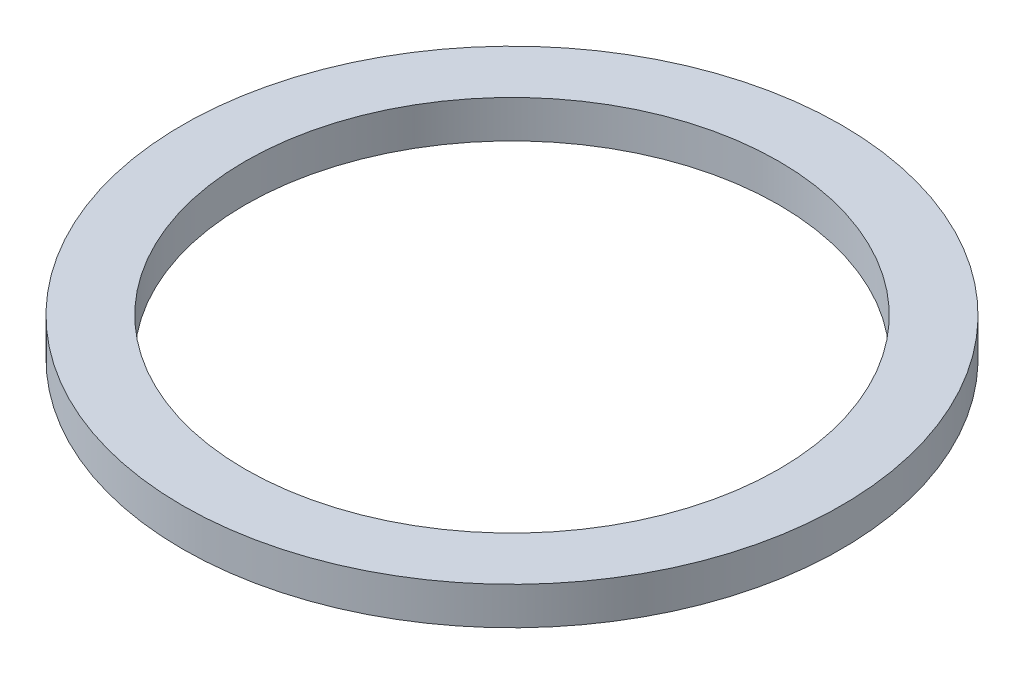
ISO-10303-21;
HEADER;
FILE_DESCRIPTION(('STEP AP214'),'2;1');
FILE_NAME('part.step','',(''),(''),'','','');
FILE_SCHEMA(('AUTOMOTIVE_DESIGN { 1 0 10303 214 1 1 1 1 }'));
ENDSEC;
DATA;
#1=APPLICATION_CONTEXT('core data for automotive mechanical design processes');
#2=APPLICATION_PROTOCOL_DEFINITION('international standard','automotive_design',2000,#1);
#3=PRODUCT_CONTEXT('',#1,'mechanical');
#4=PRODUCT('Part','Part','',(#3));
#5=PRODUCT_RELATED_PRODUCT_CATEGORY('part','',(#4));
#6=PRODUCT_DEFINITION_FORMATION('','',#4);
#7=PRODUCT_DEFINITION_CONTEXT('part definition',#1,'design');
#8=PRODUCT_DEFINITION('design','',#6,#7);
#9=PRODUCT_DEFINITION_SHAPE('','',#8);
#10=(LENGTH_UNIT() NAMED_UNIT(*) SI_UNIT(.MILLI.,.METRE.));
#11=(NAMED_UNIT(*) PLANE_ANGLE_UNIT() SI_UNIT($,.RADIAN.));
#12=(NAMED_UNIT(*) SI_UNIT($,.STERADIAN.) SOLID_ANGLE_UNIT());
#13=UNCERTAINTY_MEASURE_WITH_UNIT(LENGTH_MEASURE(1.E-05),#10,'distance_accuracy_value','');
#14=(GEOMETRIC_REPRESENTATION_CONTEXT(3) GLOBAL_UNCERTAINTY_ASSIGNED_CONTEXT((#13)) GLOBAL_UNIT_ASSIGNED_CONTEXT((#10,
#11,#12)) REPRESENTATION_CONTEXT('',''));
#15=CARTESIAN_POINT('',(0.,0.,0.));
#16=DIRECTION('',(0.,0.,1.));
#17=DIRECTION('',(1.,0.,0.));
#18=AXIS2_PLACEMENT_3D('',#15,#16,#17);
#19=CARTESIAN_POINT('',(0.,6.,0.));
#20=DIRECTION('',(0.,-1.,0.));
#21=DIRECTION('',(0.,0.,-1.));
#22=AXIS2_PLACEMENT_3D('',#19,#20,#21);
#23=CYLINDRICAL_SURFACE('',#22,52.5);
#24=CARTESIAN_POINT('',(0.,6.,0.));
#25=DIRECTION('',(0.,1.,0.));
#26=DIRECTION('',(0.,0.,1.));
#27=AXIS2_PLACEMENT_3D('',#24,#25,#26);
#28=CIRCLE('',#27,52.5);
#29=CARTESIAN_POINT('',(0.,6.,52.5));
#30=VERTEX_POINT('',#29);
#31=EDGE_CURVE('E10',#30,#30,#28,.T.);
#32=ORIENTED_EDGE('',*,*,#31,.F.);
#33=EDGE_LOOP('',(#32));
#34=FACE_BOUND('',#33,.T.);
#35=CARTESIAN_POINT('',(0.,0.,0.));
#36=DIRECTION('',(0.,1.,0.));
#37=DIRECTION('',(0.,0.,1.));
#38=AXIS2_PLACEMENT_3D('',#35,#36,#37);
#39=CIRCLE('',#38,52.5);
#40=CARTESIAN_POINT('',(0.,0.,52.5));
#41=VERTEX_POINT('',#40);
#42=EDGE_CURVE('E37',#41,#41,#39,.T.);
#43=ORIENTED_EDGE('',*,*,#42,.T.);
#44=EDGE_LOOP('',(#43));
#45=FACE_BOUND('',#44,.T.);
#46=ADVANCED_FACE('F40',(#34,#45),#23,.T.);
#47=CARTESIAN_POINT('',(0.,6.,0.));
#48=DIRECTION('',(0.,1.,0.));
#49=DIRECTION('',(0.,0.,1.));
#50=AXIS2_PLACEMENT_3D('',#47,#48,#49);
#51=PLANE('',#50);
#52=CARTESIAN_POINT('',(0.,6.,0.));
#53=DIRECTION('',(0.,1.,0.));
#54=DIRECTION('',(0.,0.,1.));
#55=AXIS2_PLACEMENT_3D('',#52,#53,#54);
#56=CIRCLE('',#55,42.5);
#57=CARTESIAN_POINT('',(0.,6.,42.5));
#58=VERTEX_POINT('',#57);
#59=EDGE_CURVE('E50',#58,#58,#56,.T.);
#60=ORIENTED_EDGE('',*,*,#59,.F.);
#61=EDGE_LOOP('',(#60));
#62=FACE_BOUND('',#61,.T.);
#63=ORIENTED_EDGE('',*,*,#31,.T.);
#64=EDGE_LOOP('',(#63));
#65=FACE_BOUND('',#64,.T.);
#66=ADVANCED_FACE('F59',(#62,#65),#51,.T.);
#67=CARTESIAN_POINT('',(0.,0.,0.));
#68=DIRECTION('',(0.,1.,0.));
#69=DIRECTION('',(0.,0.,1.));
#70=AXIS2_PLACEMENT_3D('',#67,#68,#69);
#71=PLANE('',#70);
#72=CARTESIAN_POINT('',(0.,0.,0.));
#73=DIRECTION('',(0.,1.,0.));
#74=DIRECTION('',(0.,0.,1.));
#75=AXIS2_PLACEMENT_3D('',#72,#73,#74);
#76=CIRCLE('',#75,42.5);
#77=CARTESIAN_POINT('',(0.,0.,42.5));
#78=VERTEX_POINT('',#77);
#79=EDGE_CURVE('E47',#78,#78,#76,.T.);
#80=ORIENTED_EDGE('',*,*,#79,.T.);
#81=EDGE_LOOP('',(#80));
#82=FACE_BOUND('',#81,.T.);
#83=ORIENTED_EDGE('',*,*,#42,.F.);
#84=EDGE_LOOP('',(#83));
#85=FACE_BOUND('',#84,.T.);
#86=ADVANCED_FACE('F58',(#82,#85),#71,.F.);
#87=CARTESIAN_POINT('',(0.,6.,0.));
#88=DIRECTION('',(0.,-1.,0.));
#89=DIRECTION('',(0.,0.,-1.));
#90=AXIS2_PLACEMENT_3D('',#87,#88,#89);
#91=CYLINDRICAL_SURFACE('',#90,42.5);
#92=ORIENTED_EDGE('',*,*,#59,.T.);
#93=EDGE_LOOP('',(#92));
#94=FACE_BOUND('',#93,.T.);
#95=ORIENTED_EDGE('',*,*,#79,.F.);
#96=EDGE_LOOP('',(#95));
#97=FACE_BOUND('',#96,.T.);
#98=ADVANCED_FACE('F54',(#94,#97),#91,.F.);
#99=CLOSED_SHELL('',(#46,#66,#86,#98));
#100=MANIFOLD_SOLID_BREP('B2',#99);
#101=ADVANCED_BREP_SHAPE_REPRESENTATION('',(#18,#100),#14);
#102=SHAPE_DEFINITION_REPRESENTATION(#9,#101);
ENDSEC;
END-ISO-10303-21;
